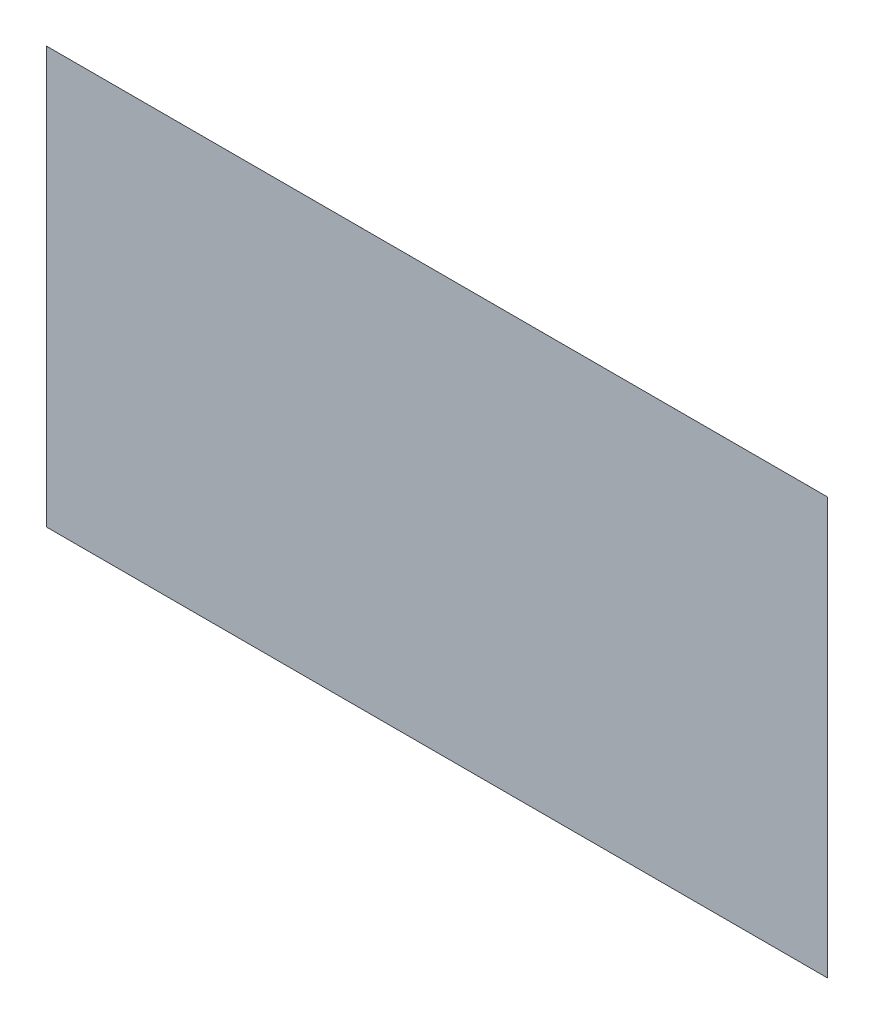
ISO-10303-21;
HEADER;
FILE_DESCRIPTION(('STEP AP214'),'2;1');
FILE_NAME('part.step','',(''),(''),'','','');
FILE_SCHEMA(('AUTOMOTIVE_DESIGN { 1 0 10303 214 1 1 1 1 }'));
ENDSEC;
DATA;
#1=APPLICATION_CONTEXT('core data for automotive mechanical design processes');
#2=APPLICATION_PROTOCOL_DEFINITION('international standard','automotive_design',2000,#1);
#3=PRODUCT_CONTEXT('',#1,'mechanical');
#4=PRODUCT('Part','Part','',(#3));
#5=PRODUCT_RELATED_PRODUCT_CATEGORY('part','',(#4));
#6=PRODUCT_DEFINITION_FORMATION('','',#4);
#7=PRODUCT_DEFINITION_CONTEXT('part definition',#1,'design');
#8=PRODUCT_DEFINITION('design','',#6,#7);
#9=PRODUCT_DEFINITION_SHAPE('','',#8);
#10=(LENGTH_UNIT() NAMED_UNIT(*) SI_UNIT(.MILLI.,.METRE.));
#11=(NAMED_UNIT(*) PLANE_ANGLE_UNIT() SI_UNIT($,.RADIAN.));
#12=(NAMED_UNIT(*) SI_UNIT($,.STERADIAN.) SOLID_ANGLE_UNIT());
#13=UNCERTAINTY_MEASURE_WITH_UNIT(LENGTH_MEASURE(1.E-05),#10,'distance_accuracy_value','');
#14=(GEOMETRIC_REPRESENTATION_CONTEXT(3) GLOBAL_UNCERTAINTY_ASSIGNED_CONTEXT((#13)) GLOBAL_UNIT_ASSIGNED_CONTEXT((#10,
#11,#12)) REPRESENTATION_CONTEXT('',''));
#15=CARTESIAN_POINT('',(0.,0.,0.));
#16=DIRECTION('',(0.,0.,1.));
#17=DIRECTION('',(1.,0.,0.));
#18=AXIS2_PLACEMENT_3D('',#15,#16,#17);
#19=CARTESIAN_POINT('',(-11.25,8.55,2.6));
#20=DIRECTION('',(-1.,0.,0.));
#21=DIRECTION('',(0.,0.,1.));
#22=AXIS2_PLACEMENT_3D('',#19,#20,#21);
#23=PLANE('',#22);
#24=DIRECTION('',(0.,1.,0.));
#25=VECTOR('',#24,1.);
#26=CARTESIAN_POINT('',(-11.25,-3.45,2.6));
#27=LINE('',#26,#25);
#28=CARTESIAN_POINT('',(-11.25,-3.45,2.6));
#29=VERTEX_POINT('',#28);
#30=CARTESIAN_POINT('',(-11.25,8.55,2.6));
#31=VERTEX_POINT('',#30);
#32=EDGE_CURVE('E38',#29,#31,#27,.T.);
#33=ORIENTED_EDGE('',*,*,#32,.F.);
#34=DIRECTION('',(0.,0.,1.));
#35=VECTOR('',#34,1.);
#36=CARTESIAN_POINT('',(-11.25,-3.45,2.6));
#37=LINE('',#36,#35);
#38=CARTESIAN_POINT('',(-11.25,-3.45,2.6001));
#39=VERTEX_POINT('',#38);
#40=EDGE_CURVE('E11',#29,#39,#37,.T.);
#41=ORIENTED_EDGE('',*,*,#40,.T.);
#42=DIRECTION('',(0.,-1.,0.));
#43=VECTOR('',#42,1.);
#44=CARTESIAN_POINT('',(-11.25,-3.45,2.6001));
#45=LINE('',#44,#43);
#46=CARTESIAN_POINT('',(-11.25,8.55,2.6001));
#47=VERTEX_POINT('',#46);
#48=EDGE_CURVE('E79',#47,#39,#45,.T.);
#49=ORIENTED_EDGE('',*,*,#48,.F.);
#50=DIRECTION('',(0.,0.,1.));
#51=VECTOR('',#50,1.);
#52=CARTESIAN_POINT('',(-11.25,8.55,2.6));
#53=LINE('',#52,#51);
#54=EDGE_CURVE('E27',#31,#47,#53,.T.);
#55=ORIENTED_EDGE('',*,*,#54,.F.);
#56=EDGE_LOOP('',(#33,#41,#49,#55));
#57=FACE_BOUND('',#56,.T.);
#58=ADVANCED_FACE('F16',(#57),#23,.T.);
#59=CARTESIAN_POINT('',(11.25,8.55,2.6));
#60=DIRECTION('',(0.,1.,0.));
#61=DIRECTION('',(1.,0.,0.));
#62=AXIS2_PLACEMENT_3D('',#59,#60,#61);
#63=PLANE('',#62);
#64=DIRECTION('',(1.,0.,0.));
#65=VECTOR('',#64,1.);
#66=CARTESIAN_POINT('',(-11.25,8.55,2.6));
#67=LINE('',#66,#65);
#68=CARTESIAN_POINT('',(11.25,8.55,2.6));
#69=VERTEX_POINT('',#68);
#70=EDGE_CURVE('E100',#31,#69,#67,.T.);
#71=ORIENTED_EDGE('',*,*,#70,.F.);
#72=ORIENTED_EDGE('',*,*,#54,.T.);
#73=DIRECTION('',(-1.,0.,0.));
#74=VECTOR('',#73,1.);
#75=CARTESIAN_POINT('',(-11.25,8.55,2.6001));
#76=LINE('',#75,#74);
#77=CARTESIAN_POINT('',(11.25,8.55,2.6001));
#78=VERTEX_POINT('',#77);
#79=EDGE_CURVE('E69',#78,#47,#76,.T.);
#80=ORIENTED_EDGE('',*,*,#79,.F.);
#81=DIRECTION('',(0.,0.,1.));
#82=VECTOR('',#81,1.);
#83=CARTESIAN_POINT('',(11.25,8.55,2.6));
#84=LINE('',#83,#82);
#85=EDGE_CURVE('E73',#69,#78,#84,.T.);
#86=ORIENTED_EDGE('',*,*,#85,.F.);
#87=EDGE_LOOP('',(#71,#72,#80,#86));
#88=FACE_BOUND('',#87,.T.);
#89=ADVANCED_FACE('F72',(#88),#63,.T.);
#90=CARTESIAN_POINT('',(11.25,-3.45,2.6));
#91=DIRECTION('',(1.,0.,0.));
#92=DIRECTION('',(0.,1.,0.));
#93=AXIS2_PLACEMENT_3D('',#90,#91,#92);
#94=PLANE('',#93);
#95=DIRECTION('',(0.,-1.,0.));
#96=VECTOR('',#95,1.);
#97=CARTESIAN_POINT('',(11.25,8.55,2.6));
#98=LINE('',#97,#96);
#99=CARTESIAN_POINT('',(11.25,-3.45,2.6));
#100=VERTEX_POINT('',#99);
#101=EDGE_CURVE('E20',#69,#100,#98,.T.);
#102=ORIENTED_EDGE('',*,*,#101,.F.);
#103=ORIENTED_EDGE('',*,*,#85,.T.);
#104=DIRECTION('',(0.,1.,0.));
#105=VECTOR('',#104,1.);
#106=CARTESIAN_POINT('',(11.25,8.55,2.6001));
#107=LINE('',#106,#105);
#108=CARTESIAN_POINT('',(11.25,-3.45,2.6001));
#109=VERTEX_POINT('',#108);
#110=EDGE_CURVE('E78',#109,#78,#107,.T.);
#111=ORIENTED_EDGE('',*,*,#110,.F.);
#112=DIRECTION('',(0.,0.,1.));
#113=VECTOR('',#112,1.);
#114=CARTESIAN_POINT('',(11.25,-3.45,2.6));
#115=LINE('',#114,#113);
#116=EDGE_CURVE('E85',#100,#109,#115,.T.);
#117=ORIENTED_EDGE('',*,*,#116,.F.);
#118=EDGE_LOOP('',(#102,#103,#111,#117));
#119=FACE_BOUND('',#118,.T.);
#120=ADVANCED_FACE('F18',(#119),#94,.T.);
#121=CARTESIAN_POINT('',(-11.25,-3.45,2.6));
#122=DIRECTION('',(0.,-1.,0.));
#123=DIRECTION('',(-1.,0.,0.));
#124=AXIS2_PLACEMENT_3D('',#121,#122,#123);
#125=PLANE('',#124);
#126=DIRECTION('',(-1.,0.,0.));
#127=VECTOR('',#126,1.);
#128=CARTESIAN_POINT('',(11.25,-3.45,2.6));
#129=LINE('',#128,#127);
#130=EDGE_CURVE('E107',#100,#29,#129,.T.);
#131=ORIENTED_EDGE('',*,*,#130,.F.);
#132=ORIENTED_EDGE('',*,*,#116,.T.);
#133=DIRECTION('',(1.,0.,0.));
#134=VECTOR('',#133,1.);
#135=CARTESIAN_POINT('',(11.25,-3.45,2.6001));
#136=LINE('',#135,#134);
#137=EDGE_CURVE('E90',#39,#109,#136,.T.);
#138=ORIENTED_EDGE('',*,*,#137,.F.);
#139=ORIENTED_EDGE('',*,*,#40,.F.);
#140=EDGE_LOOP('',(#131,#132,#138,#139));
#141=FACE_BOUND('',#140,.T.);
#142=ADVANCED_FACE('F115',(#141),#125,.T.);
#143=CARTESIAN_POINT('',(0.,2.55,2.6001));
#144=DIRECTION('',(0.,0.,1.));
#145=DIRECTION('',(1.,0.,0.));
#146=AXIS2_PLACEMENT_3D('',#143,#144,#145);
#147=PLANE('',#146);
#148=ORIENTED_EDGE('',*,*,#137,.T.);
#149=ORIENTED_EDGE('',*,*,#110,.T.);
#150=ORIENTED_EDGE('',*,*,#79,.T.);
#151=ORIENTED_EDGE('',*,*,#48,.T.);
#152=EDGE_LOOP('',(#148,#149,#150,#151));
#153=FACE_BOUND('',#152,.T.);
#154=ADVANCED_FACE('F88',(#153),#147,.T.);
#155=CARTESIAN_POINT('',(0.,2.55,2.6));
#156=DIRECTION('',(0.,0.,1.));
#157=DIRECTION('',(1.,0.,0.));
#158=AXIS2_PLACEMENT_3D('',#155,#156,#157);
#159=PLANE('',#158);
#160=ORIENTED_EDGE('',*,*,#130,.T.);
#161=ORIENTED_EDGE('',*,*,#32,.T.);
#162=ORIENTED_EDGE('',*,*,#70,.T.);
#163=ORIENTED_EDGE('',*,*,#101,.T.);
#164=EDGE_LOOP('',(#160,#161,#162,#163));
#165=FACE_BOUND('',#164,.T.);
#166=ADVANCED_FACE('F112',(#165),#159,.F.);
#167=CLOSED_SHELL('',(#58,#89,#120,#142,#154,#166));
#168=MANIFOLD_SOLID_BREP('B1',#167);
#169=ADVANCED_BREP_SHAPE_REPRESENTATION('',(#18,#168),#14);
#170=SHAPE_DEFINITION_REPRESENTATION(#9,#169);
ENDSEC;
END-ISO-10303-21;
